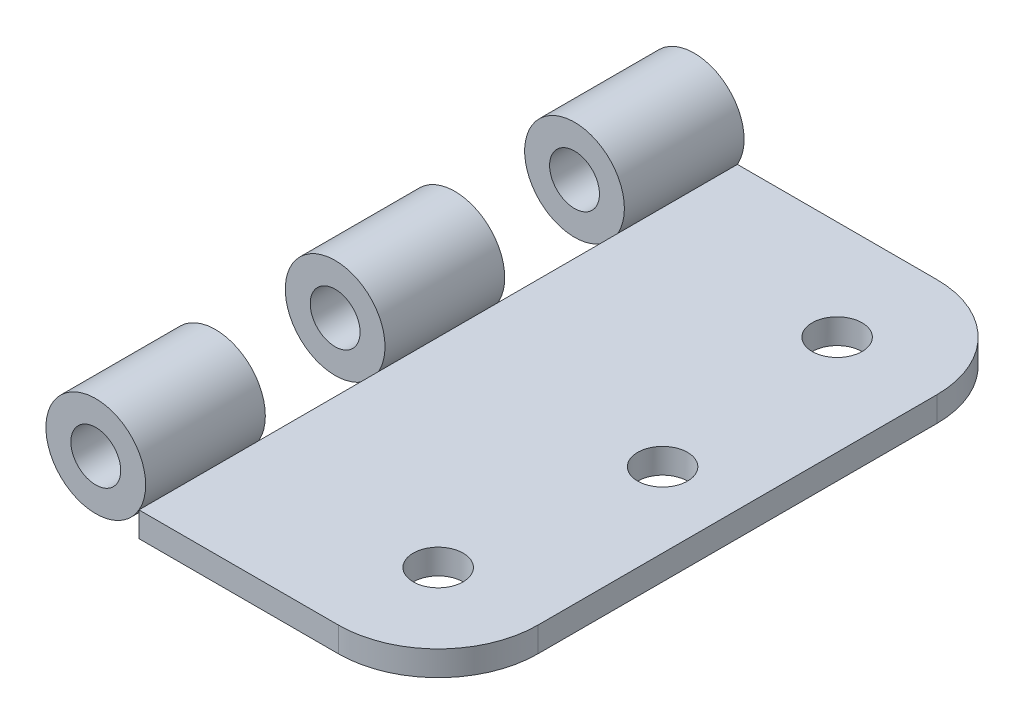
ISO-10303-21;
HEADER;
FILE_DESCRIPTION(('STEP AP214'),'2;1');
FILE_NAME('part.step','',(''),(''),'','','');
FILE_SCHEMA(('AUTOMOTIVE_DESIGN { 1 0 10303 214 1 1 1 1 }'));
ENDSEC;
DATA;
#1=APPLICATION_CONTEXT('core data for automotive mechanical design processes');
#2=APPLICATION_PROTOCOL_DEFINITION('international standard','automotive_design',2000,#1);
#3=PRODUCT_CONTEXT('',#1,'mechanical');
#4=PRODUCT('Part','Part','',(#3));
#5=PRODUCT_RELATED_PRODUCT_CATEGORY('part','',(#4));
#6=PRODUCT_DEFINITION_FORMATION('','',#4);
#7=PRODUCT_DEFINITION_CONTEXT('part definition',#1,'design');
#8=PRODUCT_DEFINITION('design','',#6,#7);
#9=PRODUCT_DEFINITION_SHAPE('','',#8);
#10=(LENGTH_UNIT() NAMED_UNIT(*) SI_UNIT(.MILLI.,.METRE.));
#11=(NAMED_UNIT(*) PLANE_ANGLE_UNIT() SI_UNIT($,.RADIAN.));
#12=(NAMED_UNIT(*) SI_UNIT($,.STERADIAN.) SOLID_ANGLE_UNIT());
#13=UNCERTAINTY_MEASURE_WITH_UNIT(LENGTH_MEASURE(1.E-05),#10,'distance_accuracy_value','');
#14=(GEOMETRIC_REPRESENTATION_CONTEXT(3) GLOBAL_UNCERTAINTY_ASSIGNED_CONTEXT((#13)) GLOBAL_UNIT_ASSIGNED_CONTEXT((#10,
#11,#12)) REPRESENTATION_CONTEXT('',''));
#15=CARTESIAN_POINT('',(0.,0.,0.));
#16=DIRECTION('',(0.,0.,1.));
#17=DIRECTION('',(1.,0.,0.));
#18=AXIS2_PLACEMENT_3D('',#15,#16,#17);
#19=CARTESIAN_POINT('',(0.,3.175,0.));
#20=DIRECTION('',(1.,0.,0.));
#21=DIRECTION('',(0.,0.,-1.));
#22=AXIS2_PLACEMENT_3D('',#19,#20,#21);
#23=PLANE('',#22);
#24=DIRECTION('',(0.,0.,1.));
#25=VECTOR('',#24,1.);
#26=CARTESIAN_POINT('',(0.,0.,0.));
#27=LINE('',#26,#25);
#28=CARTESIAN_POINT('',(0.,0.,-76.2));
#29=VERTEX_POINT('',#28);
#30=CARTESIAN_POINT('',(0.,0.,0.));
#31=VERTEX_POINT('',#30);
#32=EDGE_CURVE('P0_E89',#29,#31,#27,.T.);
#33=ORIENTED_EDGE('',*,*,#32,.T.);
#34=DIRECTION('',(0.,-1.,0.));
#35=VECTOR('',#34,1.);
#36=CARTESIAN_POINT('',(0.,3.175,0.));
#37=LINE('',#36,#35);
#38=CARTESIAN_POINT('',(0.,3.175,0.));
#39=VERTEX_POINT('',#38);
#40=EDGE_CURVE('P0_E84',#39,#31,#37,.T.);
#41=ORIENTED_EDGE('',*,*,#40,.F.);
#42=DIRECTION('',(0.,0.,1.));
#43=VECTOR('',#42,1.);
#44=CARTESIAN_POINT('',(0.,3.175,0.));
#45=LINE('',#44,#43);
#46=CARTESIAN_POINT('',(0.,3.175,-76.2));
#47=VERTEX_POINT('',#46);
#48=EDGE_CURVE('P0_E71',#47,#39,#45,.T.);
#49=ORIENTED_EDGE('',*,*,#48,.F.);
#50=DIRECTION('',(0.,-1.,0.));
#51=VECTOR('',#50,1.);
#52=CARTESIAN_POINT('',(0.,3.175,-76.2));
#53=LINE('',#52,#51);
#54=EDGE_CURVE('P0_E91',#47,#29,#53,.T.);
#55=ORIENTED_EDGE('',*,*,#54,.T.);
#56=EDGE_LOOP('',(#33,#41,#49,#55));
#57=FACE_BOUND('',#56,.T.);
#58=ADVANCED_FACE('P0_F17',(#57),#23,.F.);
#59=CARTESIAN_POINT('',(0.,3.175,0.));
#60=DIRECTION('',(0.,0.,-1.));
#61=DIRECTION('',(-1.,0.,0.));
#62=AXIS2_PLACEMENT_3D('',#59,#60,#61);
#63=PLANE('',#62);
#64=DIRECTION('',(1.,0.,0.));
#65=VECTOR('',#64,1.);
#66=CARTESIAN_POINT('',(0.,0.,0.));
#67=LINE('',#66,#65);
#68=CARTESIAN_POINT('',(25.4,0.,0.));
#69=VERTEX_POINT('',#68);
#70=EDGE_CURVE('P0_E117',#31,#69,#67,.T.);
#71=ORIENTED_EDGE('',*,*,#70,.T.);
#72=DIRECTION('',(0.,-1.,0.));
#73=VECTOR('',#72,1.);
#74=CARTESIAN_POINT('',(25.4,3.175,0.));
#75=LINE('',#74,#73);
#76=CARTESIAN_POINT('',(25.4,3.175,0.));
#77=VERTEX_POINT('',#76);
#78=EDGE_CURVE('P0_E40',#69,#77,#75,.F.);
#79=ORIENTED_EDGE('',*,*,#78,.T.);
#80=DIRECTION('',(1.,0.,0.));
#81=VECTOR('',#80,1.);
#82=CARTESIAN_POINT('',(0.,3.175,0.));
#83=LINE('',#82,#81);
#84=EDGE_CURVE('P0_E73',#39,#77,#83,.T.);
#85=ORIENTED_EDGE('',*,*,#84,.F.);
#86=ORIENTED_EDGE('',*,*,#40,.T.);
#87=EDGE_LOOP('',(#71,#79,#85,#86));
#88=FACE_BOUND('',#87,.T.);
#89=ADVANCED_FACE('P0_F83',(#88),#63,.F.);
#90=CARTESIAN_POINT('',(38.1,3.175,0.));
#91=DIRECTION('',(-1.,0.,0.));
#92=DIRECTION('',(0.,0.,1.));
#93=AXIS2_PLACEMENT_3D('',#90,#91,#92);
#94=PLANE('',#93);
#95=DIRECTION('',(0.,0.,-1.));
#96=VECTOR('',#95,1.);
#97=CARTESIAN_POINT('',(38.1,3.175,0.));
#98=LINE('',#97,#96);
#99=CARTESIAN_POINT('',(38.1,3.175,-12.7));
#100=VERTEX_POINT('',#99);
#101=CARTESIAN_POINT('',(38.1,3.175,-63.5));
#102=VERTEX_POINT('',#101);
#103=EDGE_CURVE('P0_E86',#100,#102,#98,.T.);
#104=ORIENTED_EDGE('',*,*,#103,.F.);
#105=DIRECTION('',(0.,-1.,0.));
#106=VECTOR('',#105,1.);
#107=CARTESIAN_POINT('',(38.1,3.175,-12.7));
#108=LINE('',#107,#106);
#109=CARTESIAN_POINT('',(38.1,0.,-12.7));
#110=VERTEX_POINT('',#109);
#111=EDGE_CURVE('P0_E93',#100,#110,#108,.T.);
#112=ORIENTED_EDGE('',*,*,#111,.T.);
#113=DIRECTION('',(0.,0.,-1.));
#114=VECTOR('',#113,1.);
#115=CARTESIAN_POINT('',(38.1,0.,0.));
#116=LINE('',#115,#114);
#117=CARTESIAN_POINT('',(38.1,0.,-63.5));
#118=VERTEX_POINT('',#117);
#119=EDGE_CURVE('P0_E118',#110,#118,#116,.T.);
#120=ORIENTED_EDGE('',*,*,#119,.T.);
#121=DIRECTION('',(0.,-1.,0.));
#122=VECTOR('',#121,1.);
#123=CARTESIAN_POINT('',(38.1,3.175,-63.5));
#124=LINE('',#123,#122);
#125=EDGE_CURVE('P0_E90',#118,#102,#124,.F.);
#126=ORIENTED_EDGE('',*,*,#125,.T.);
#127=EDGE_LOOP('',(#104,#112,#120,#126));
#128=FACE_BOUND('',#127,.T.);
#129=ADVANCED_FACE('P0_F109',(#128),#94,.F.);
#130=CARTESIAN_POINT('',(0.,3.175,-76.2));
#131=DIRECTION('',(0.,0.,1.));
#132=DIRECTION('',(1.,0.,0.));
#133=AXIS2_PLACEMENT_3D('',#130,#131,#132);
#134=PLANE('',#133);
#135=DIRECTION('',(-1.,0.,0.));
#136=VECTOR('',#135,1.);
#137=CARTESIAN_POINT('',(0.,3.175,-76.2));
#138=LINE('',#137,#136);
#139=CARTESIAN_POINT('',(25.4,3.175,-76.2));
#140=VERTEX_POINT('',#139);
#141=EDGE_CURVE('P0_E75',#140,#47,#138,.T.);
#142=ORIENTED_EDGE('',*,*,#141,.F.);
#143=DIRECTION('',(0.,-1.,0.));
#144=VECTOR('',#143,1.);
#145=CARTESIAN_POINT('',(25.4,3.175,-76.2));
#146=LINE('',#145,#144);
#147=CARTESIAN_POINT('',(25.4,0.,-76.2));
#148=VERTEX_POINT('',#147);
#149=EDGE_CURVE('P0_E11',#140,#148,#146,.T.);
#150=ORIENTED_EDGE('',*,*,#149,.T.);
#151=DIRECTION('',(-1.,0.,0.));
#152=VECTOR('',#151,1.);
#153=CARTESIAN_POINT('',(0.,0.,-76.2));
#154=LINE('',#153,#152);
#155=EDGE_CURVE('P0_E80',#148,#29,#154,.T.);
#156=ORIENTED_EDGE('',*,*,#155,.T.);
#157=ORIENTED_EDGE('',*,*,#54,.F.);
#158=EDGE_LOOP('',(#142,#150,#156,#157));
#159=FACE_BOUND('',#158,.T.);
#160=ADVANCED_FACE('P0_F126',(#159),#134,.F.);
#161=CARTESIAN_POINT('',(0.,3.175,-76.2));
#162=DIRECTION('',(0.,-1.,0.));
#163=DIRECTION('',(0.,0.,-1.));
#164=AXIS2_PLACEMENT_3D('',#161,#162,#163);
#165=PLANE('',#164);
#166=CARTESIAN_POINT('',(25.4,3.175,-12.7));
#167=DIRECTION('',(0.,1.,0.));
#168=DIRECTION('',(0.,0.,-1.));
#169=AXIS2_PLACEMENT_3D('',#166,#167,#168);
#170=CIRCLE('',#169,3.175);
#171=CARTESIAN_POINT('',(25.4,3.175,-15.875));
#172=VERTEX_POINT('',#171);
#173=EDGE_CURVE('P0_E173',#172,#172,#170,.T.);
#174=ORIENTED_EDGE('',*,*,#173,.F.);
#175=EDGE_LOOP('',(#174));
#176=FACE_BOUND('',#175,.T.);
#177=CARTESIAN_POINT('',(28.575,3.175,-38.1));
#178=DIRECTION('',(0.,1.,0.));
#179=DIRECTION('',(0.,0.,1.));
#180=AXIS2_PLACEMENT_3D('',#177,#178,#179);
#181=CIRCLE('',#180,3.175);
#182=CARTESIAN_POINT('',(28.575,3.175,-34.925));
#183=VERTEX_POINT('',#182);
#184=EDGE_CURVE('P0_E177',#183,#183,#181,.T.);
#185=ORIENTED_EDGE('',*,*,#184,.F.);
#186=EDGE_LOOP('',(#185));
#187=FACE_BOUND('',#186,.T.);
#188=CARTESIAN_POINT('',(25.4,3.175,-63.5));
#189=DIRECTION('',(0.,1.,0.));
#190=DIRECTION('',(0.,0.,1.));
#191=AXIS2_PLACEMENT_3D('',#188,#189,#190);
#192=CIRCLE('',#191,3.175);
#193=CARTESIAN_POINT('',(25.4,3.175,-60.325));
#194=VERTEX_POINT('',#193);
#195=EDGE_CURVE('P0_E121',#194,#194,#192,.T.);
#196=ORIENTED_EDGE('',*,*,#195,.F.);
#197=EDGE_LOOP('',(#196));
#198=FACE_BOUND('',#197,.T.);
#199=ORIENTED_EDGE('',*,*,#84,.T.);
#200=CARTESIAN_POINT('',(25.4,3.175,-12.7));
#201=DIRECTION('',(0.,-1.,0.));
#202=DIRECTION('',(0.,0.,-1.));
#203=AXIS2_PLACEMENT_3D('',#200,#201,#202);
#204=CIRCLE('',#203,12.7);
#205=EDGE_CURVE('P0_E25',#77,#100,#204,.F.);
#206=ORIENTED_EDGE('',*,*,#205,.T.);
#207=ORIENTED_EDGE('',*,*,#103,.T.);
#208=CARTESIAN_POINT('',(25.4,3.175,-63.5));
#209=DIRECTION('',(0.,-1.,0.));
#210=DIRECTION('',(0.,0.,-1.));
#211=AXIS2_PLACEMENT_3D('',#208,#209,#210);
#212=CIRCLE('',#211,12.7);
#213=EDGE_CURVE('P0_E32',#102,#140,#212,.F.);
#214=ORIENTED_EDGE('',*,*,#213,.T.);
#215=ORIENTED_EDGE('',*,*,#141,.T.);
#216=ORIENTED_EDGE('',*,*,#48,.T.);
#217=EDGE_LOOP('',(#199,#206,#207,#214,#215,#216));
#218=FACE_BOUND('',#217,.T.);
#219=ADVANCED_FACE('P0_F72',(#176,#187,#198,#218),#165,.F.);
#220=CARTESIAN_POINT('',(0.,0.,-76.2));
#221=DIRECTION('',(0.,-1.,0.));
#222=DIRECTION('',(0.,0.,-1.));
#223=AXIS2_PLACEMENT_3D('',#220,#221,#222);
#224=PLANE('',#223);
#225=CARTESIAN_POINT('',(25.4,0.,-12.7));
#226=DIRECTION('',(0.,-1.,0.));
#227=DIRECTION('',(0.,0.,-1.));
#228=AXIS2_PLACEMENT_3D('',#225,#226,#227);
#229=CIRCLE('',#228,3.175);
#230=CARTESIAN_POINT('',(25.4,0.,-15.875));
#231=VERTEX_POINT('',#230);
#232=EDGE_CURVE('P0_E170',#231,#231,#229,.F.);
#233=ORIENTED_EDGE('',*,*,#232,.T.);
#234=EDGE_LOOP('',(#233));
#235=FACE_BOUND('',#234,.T.);
#236=CARTESIAN_POINT('',(28.575,0.,-38.1));
#237=DIRECTION('',(0.,-1.,0.));
#238=DIRECTION('',(0.,0.,-1.));
#239=AXIS2_PLACEMENT_3D('',#236,#237,#238);
#240=CIRCLE('',#239,3.175);
#241=CARTESIAN_POINT('',(28.575,0.,-41.275));
#242=VERTEX_POINT('',#241);
#243=EDGE_CURVE('P0_E174',#242,#242,#240,.F.);
#244=ORIENTED_EDGE('',*,*,#243,.T.);
#245=EDGE_LOOP('',(#244));
#246=FACE_BOUND('',#245,.T.);
#247=CARTESIAN_POINT('',(25.4,0.,-63.5));
#248=DIRECTION('',(0.,-1.,0.));
#249=DIRECTION('',(0.,0.,-1.));
#250=AXIS2_PLACEMENT_3D('',#247,#248,#249);
#251=CIRCLE('',#250,3.175);
#252=CARTESIAN_POINT('',(25.4,0.,-66.675));
#253=VERTEX_POINT('',#252);
#254=EDGE_CURVE('P0_E182',#253,#253,#251,.F.);
#255=ORIENTED_EDGE('',*,*,#254,.T.);
#256=EDGE_LOOP('',(#255));
#257=FACE_BOUND('',#256,.T.);
#258=ORIENTED_EDGE('',*,*,#119,.F.);
#259=CARTESIAN_POINT('',(25.4,0.,-12.7));
#260=DIRECTION('',(0.,-1.,0.));
#261=DIRECTION('',(0.,0.,-1.));
#262=AXIS2_PLACEMENT_3D('',#259,#260,#261);
#263=CIRCLE('',#262,12.7);
#264=EDGE_CURVE('P0_E102',#110,#69,#263,.T.);
#265=ORIENTED_EDGE('',*,*,#264,.T.);
#266=ORIENTED_EDGE('',*,*,#70,.F.);
#267=ORIENTED_EDGE('',*,*,#32,.F.);
#268=ORIENTED_EDGE('',*,*,#155,.F.);
#269=CARTESIAN_POINT('',(25.4,0.,-63.5));
#270=DIRECTION('',(0.,-1.,0.));
#271=DIRECTION('',(0.,0.,-1.));
#272=AXIS2_PLACEMENT_3D('',#269,#270,#271);
#273=CIRCLE('',#272,12.7);
#274=EDGE_CURVE('P0_E100',#148,#118,#273,.T.);
#275=ORIENTED_EDGE('',*,*,#274,.T.);
#276=EDGE_LOOP('',(#258,#265,#266,#267,#268,#275));
#277=FACE_BOUND('',#276,.T.);
#278=ADVANCED_FACE('P0_F116',(#235,#246,#257,#277),#224,.T.);
#279=CARTESIAN_POINT('',(25.4,-0.00100000000000013,-63.5));
#280=DIRECTION('',(0.,1.,0.));
#281=DIRECTION('',(0.,0.,1.));
#282=AXIS2_PLACEMENT_3D('',#279,#280,#281);
#283=CYLINDRICAL_SURFACE('',#282,3.175);
#284=ORIENTED_EDGE('',*,*,#254,.F.);
#285=EDGE_LOOP('',(#284));
#286=FACE_BOUND('',#285,.T.);
#287=ORIENTED_EDGE('',*,*,#195,.T.);
#288=EDGE_LOOP('',(#287));
#289=FACE_BOUND('',#288,.T.);
#290=ADVANCED_FACE('P0_F150',(#286,#289),#283,.F.);
#291=CARTESIAN_POINT('',(28.575,-0.00100000000000013,-38.1));
#292=DIRECTION('',(0.,1.,0.));
#293=DIRECTION('',(0.,0.,1.));
#294=AXIS2_PLACEMENT_3D('',#291,#292,#293);
#295=CYLINDRICAL_SURFACE('',#294,3.175);
#296=ORIENTED_EDGE('',*,*,#243,.F.);
#297=EDGE_LOOP('',(#296));
#298=FACE_BOUND('',#297,.T.);
#299=ORIENTED_EDGE('',*,*,#184,.T.);
#300=EDGE_LOOP('',(#299));
#301=FACE_BOUND('',#300,.T.);
#302=ADVANCED_FACE('P0_F157',(#298,#301),#295,.F.);
#303=CARTESIAN_POINT('',(25.4,-0.00100000000000013,-12.7));
#304=DIRECTION('',(0.,1.,0.));
#305=DIRECTION('',(0.,0.,1.));
#306=AXIS2_PLACEMENT_3D('',#303,#304,#305);
#307=CYLINDRICAL_SURFACE('',#306,3.175);
#308=ORIENTED_EDGE('',*,*,#232,.F.);
#309=EDGE_LOOP('',(#308));
#310=FACE_BOUND('',#309,.T.);
#311=ORIENTED_EDGE('',*,*,#173,.T.);
#312=EDGE_LOOP('',(#311));
#313=FACE_BOUND('',#312,.T.);
#314=ADVANCED_FACE('P0_F135',(#310,#313),#307,.F.);
#315=CARTESIAN_POINT('',(25.4,3.175,-12.7));
#316=DIRECTION('',(0.,-1.,0.));
#317=DIRECTION('',(0.,0.,-1.));
#318=AXIS2_PLACEMENT_3D('',#315,#316,#317);
#319=CYLINDRICAL_SURFACE('',#318,12.7);
#320=ORIENTED_EDGE('',*,*,#205,.F.);
#321=ORIENTED_EDGE('',*,*,#78,.F.);
#322=ORIENTED_EDGE('',*,*,#264,.F.);
#323=ORIENTED_EDGE('',*,*,#111,.F.);
#324=EDGE_LOOP('',(#320,#321,#322,#323));
#325=FACE_BOUND('',#324,.T.);
#326=ADVANCED_FACE('P0_F114',(#325),#319,.T.);
#327=CARTESIAN_POINT('',(25.4,3.175,-63.5));
#328=DIRECTION('',(0.,-1.,0.));
#329=DIRECTION('',(0.,0.,-1.));
#330=AXIS2_PLACEMENT_3D('',#327,#328,#329);
#331=CYLINDRICAL_SURFACE('',#330,12.7);
#332=ORIENTED_EDGE('',*,*,#213,.F.);
#333=ORIENTED_EDGE('',*,*,#125,.F.);
#334=ORIENTED_EDGE('',*,*,#274,.F.);
#335=ORIENTED_EDGE('',*,*,#149,.F.);
#336=EDGE_LOOP('',(#332,#333,#334,#335));
#337=FACE_BOUND('',#336,.T.);
#338=ADVANCED_FACE('P0_F19',(#337),#331,.T.);
#339=CLOSED_SHELL('',(#58,#89,#129,#160,#219,#278,#290,#302,#314,#326,#338));
#340=MANIFOLD_SOLID_BREP('P0_B1',#339);
#341=CARTESIAN_POINT('',(-5.49926131403119,6.35,-15.24));
#342=DIRECTION('',(0.,0.,1.));
#343=DIRECTION('',(1.,0.,0.));
#344=AXIS2_PLACEMENT_3D('',#341,#342,#343);
#345=CYLINDRICAL_SURFACE('',#344,6.35);
#346=CARTESIAN_POINT('',(-5.49926131403119,6.35,-15.24));
#347=DIRECTION('',(0.,0.,1.));
#348=DIRECTION('',(1.,0.,0.));
#349=AXIS2_PLACEMENT_3D('',#346,#347,#348);
#350=CIRCLE('',#349,6.35);
#351=CARTESIAN_POINT('',(0.85073868596881,6.35,-15.24));
#352=VERTEX_POINT('',#351);
#353=EDGE_CURVE('P1_E10',#352,#352,#350,.T.);
#354=ORIENTED_EDGE('',*,*,#353,.T.);
#355=EDGE_LOOP('',(#354));
#356=FACE_BOUND('',#355,.T.);
#357=CARTESIAN_POINT('',(-5.49926131403119,6.35,0.));
#358=DIRECTION('',(0.,0.,1.));
#359=DIRECTION('',(1.,0.,0.));
#360=AXIS2_PLACEMENT_3D('',#357,#358,#359);
#361=CIRCLE('',#360,6.35);
#362=CARTESIAN_POINT('',(0.85073868596881,6.35,0.));
#363=VERTEX_POINT('',#362);
#364=EDGE_CURVE('P1_E18',#363,#363,#361,.T.);
#365=ORIENTED_EDGE('',*,*,#364,.F.);
#366=EDGE_LOOP('',(#365));
#367=FACE_BOUND('',#366,.T.);
#368=ADVANCED_FACE('P1_F15',(#356,#367),#345,.T.);
#369=CARTESIAN_POINT('',(-5.49926131403119,6.35,-15.24));
#370=DIRECTION('',(0.,0.,1.));
#371=DIRECTION('',(1.,0.,0.));
#372=AXIS2_PLACEMENT_3D('',#369,#370,#371);
#373=PLANE('',#372);
#374=CARTESIAN_POINT('',(-5.49926131403119,6.35,-15.24));
#375=DIRECTION('',(0.,0.,1.));
#376=DIRECTION('',(1.,0.,0.));
#377=AXIS2_PLACEMENT_3D('',#374,#375,#376);
#378=CIRCLE('',#377,3.175);
#379=CARTESIAN_POINT('',(-2.32426131403119,6.35,-15.24));
#380=VERTEX_POINT('',#379);
#381=EDGE_CURVE('P1_E25',#380,#380,#378,.T.);
#382=ORIENTED_EDGE('',*,*,#381,.T.);
#383=EDGE_LOOP('',(#382));
#384=FACE_BOUND('',#383,.T.);
#385=ORIENTED_EDGE('',*,*,#353,.F.);
#386=EDGE_LOOP('',(#385));
#387=FACE_BOUND('',#386,.T.);
#388=ADVANCED_FACE('P1_F33',(#384,#387),#373,.F.);
#389=CARTESIAN_POINT('',(-5.49926131403119,6.35,0.));
#390=DIRECTION('',(0.,0.,1.));
#391=DIRECTION('',(1.,0.,0.));
#392=AXIS2_PLACEMENT_3D('',#389,#390,#391);
#393=PLANE('',#392);
#394=CARTESIAN_POINT('',(-5.49926131403119,6.35,0.));
#395=DIRECTION('',(0.,0.,1.));
#396=DIRECTION('',(1.,0.,0.));
#397=AXIS2_PLACEMENT_3D('',#394,#395,#396);
#398=CIRCLE('',#397,3.175);
#399=CARTESIAN_POINT('',(-2.32426131403119,6.35,0.));
#400=VERTEX_POINT('',#399);
#401=EDGE_CURVE('P1_E27',#400,#400,#398,.T.);
#402=ORIENTED_EDGE('',*,*,#401,.F.);
#403=EDGE_LOOP('',(#402));
#404=FACE_BOUND('',#403,.T.);
#405=ORIENTED_EDGE('',*,*,#364,.T.);
#406=EDGE_LOOP('',(#405));
#407=FACE_BOUND('',#406,.T.);
#408=ADVANCED_FACE('P1_F39',(#404,#407),#393,.T.);
#409=CARTESIAN_POINT('',(-5.49926131403119,6.35,-15.24));
#410=DIRECTION('',(0.,0.,1.));
#411=DIRECTION('',(1.,0.,0.));
#412=AXIS2_PLACEMENT_3D('',#409,#410,#411);
#413=CYLINDRICAL_SURFACE('',#412,3.175);
#414=ORIENTED_EDGE('',*,*,#381,.F.);
#415=EDGE_LOOP('',(#414));
#416=FACE_BOUND('',#415,.T.);
#417=ORIENTED_EDGE('',*,*,#401,.T.);
#418=EDGE_LOOP('',(#417));
#419=FACE_BOUND('',#418,.T.);
#420=ADVANCED_FACE('P1_F36',(#416,#419),#413,.F.);
#421=CLOSED_SHELL('',(#368,#388,#408,#420));
#422=MANIFOLD_SOLID_BREP('P1_B1',#421);
#423=CARTESIAN_POINT('',(-5.49926131403119,6.35,-45.72));
#424=DIRECTION('',(0.,0.,1.));
#425=DIRECTION('',(1.,0.,0.));
#426=AXIS2_PLACEMENT_3D('',#423,#424,#425);
#427=CYLINDRICAL_SURFACE('',#426,6.35);
#428=CARTESIAN_POINT('',(-5.49926131403119,6.35,-45.72));
#429=DIRECTION('',(0.,0.,1.));
#430=DIRECTION('',(1.,0.,0.));
#431=AXIS2_PLACEMENT_3D('',#428,#429,#430);
#432=CIRCLE('',#431,6.35);
#433=CARTESIAN_POINT('',(0.85073868596881,6.35,-45.72));
#434=VERTEX_POINT('',#433);
#435=EDGE_CURVE('P2_E10',#434,#434,#432,.T.);
#436=ORIENTED_EDGE('',*,*,#435,.T.);
#437=EDGE_LOOP('',(#436));
#438=FACE_BOUND('',#437,.T.);
#439=CARTESIAN_POINT('',(-5.49926131403119,6.35,-30.48));
#440=DIRECTION('',(0.,0.,1.));
#441=DIRECTION('',(1.,0.,0.));
#442=AXIS2_PLACEMENT_3D('',#439,#440,#441);
#443=CIRCLE('',#442,6.35);
#444=CARTESIAN_POINT('',(0.85073868596881,6.35,-30.48));
#445=VERTEX_POINT('',#444);
#446=EDGE_CURVE('P2_E18',#445,#445,#443,.T.);
#447=ORIENTED_EDGE('',*,*,#446,.F.);
#448=EDGE_LOOP('',(#447));
#449=FACE_BOUND('',#448,.T.);
#450=ADVANCED_FACE('P2_F15',(#438,#449),#427,.T.);
#451=CARTESIAN_POINT('',(-5.49926131403119,6.35,-45.72));
#452=DIRECTION('',(0.,0.,1.));
#453=DIRECTION('',(1.,0.,0.));
#454=AXIS2_PLACEMENT_3D('',#451,#452,#453);
#455=PLANE('',#454);
#456=CARTESIAN_POINT('',(-5.49926131403119,6.35,-45.72));
#457=DIRECTION('',(0.,0.,1.));
#458=DIRECTION('',(1.,0.,0.));
#459=AXIS2_PLACEMENT_3D('',#456,#457,#458);
#460=CIRCLE('',#459,3.175);
#461=CARTESIAN_POINT('',(-2.32426131403119,6.35,-45.72));
#462=VERTEX_POINT('',#461);
#463=EDGE_CURVE('P2_E25',#462,#462,#460,.T.);
#464=ORIENTED_EDGE('',*,*,#463,.T.);
#465=EDGE_LOOP('',(#464));
#466=FACE_BOUND('',#465,.T.);
#467=ORIENTED_EDGE('',*,*,#435,.F.);
#468=EDGE_LOOP('',(#467));
#469=FACE_BOUND('',#468,.T.);
#470=ADVANCED_FACE('P2_F33',(#466,#469),#455,.F.);
#471=CARTESIAN_POINT('',(-5.49926131403119,6.35,-30.48));
#472=DIRECTION('',(0.,0.,1.));
#473=DIRECTION('',(1.,0.,0.));
#474=AXIS2_PLACEMENT_3D('',#471,#472,#473);
#475=PLANE('',#474);
#476=CARTESIAN_POINT('',(-5.49926131403119,6.35,-30.48));
#477=DIRECTION('',(0.,0.,1.));
#478=DIRECTION('',(1.,0.,0.));
#479=AXIS2_PLACEMENT_3D('',#476,#477,#478);
#480=CIRCLE('',#479,3.175);
#481=CARTESIAN_POINT('',(-2.32426131403119,6.35,-30.48));
#482=VERTEX_POINT('',#481);
#483=EDGE_CURVE('P2_E27',#482,#482,#480,.T.);
#484=ORIENTED_EDGE('',*,*,#483,.F.);
#485=EDGE_LOOP('',(#484));
#486=FACE_BOUND('',#485,.T.);
#487=ORIENTED_EDGE('',*,*,#446,.T.);
#488=EDGE_LOOP('',(#487));
#489=FACE_BOUND('',#488,.T.);
#490=ADVANCED_FACE('P2_F39',(#486,#489),#475,.T.);
#491=CARTESIAN_POINT('',(-5.49926131403119,6.35,-45.72));
#492=DIRECTION('',(0.,0.,1.));
#493=DIRECTION('',(1.,0.,0.));
#494=AXIS2_PLACEMENT_3D('',#491,#492,#493);
#495=CYLINDRICAL_SURFACE('',#494,3.175);
#496=ORIENTED_EDGE('',*,*,#463,.F.);
#497=EDGE_LOOP('',(#496));
#498=FACE_BOUND('',#497,.T.);
#499=ORIENTED_EDGE('',*,*,#483,.T.);
#500=EDGE_LOOP('',(#499));
#501=FACE_BOUND('',#500,.T.);
#502=ADVANCED_FACE('P2_F36',(#498,#501),#495,.F.);
#503=CLOSED_SHELL('',(#450,#470,#490,#502));
#504=MANIFOLD_SOLID_BREP('P2_B1',#503);
#505=CARTESIAN_POINT('',(-5.49926131403119,6.35,-76.2));
#506=DIRECTION('',(0.,0.,1.));
#507=DIRECTION('',(1.,0.,0.));
#508=AXIS2_PLACEMENT_3D('',#505,#506,#507);
#509=CYLINDRICAL_SURFACE('',#508,6.35);
#510=CARTESIAN_POINT('',(-5.49926131403119,6.35,-76.2));
#511=DIRECTION('',(0.,0.,1.));
#512=DIRECTION('',(1.,0.,0.));
#513=AXIS2_PLACEMENT_3D('',#510,#511,#512);
#514=CIRCLE('',#513,6.35);
#515=CARTESIAN_POINT('',(0.85073868596881,6.35,-76.2));
#516=VERTEX_POINT('',#515);
#517=EDGE_CURVE('P3_E10',#516,#516,#514,.T.);
#518=ORIENTED_EDGE('',*,*,#517,.T.);
#519=EDGE_LOOP('',(#518));
#520=FACE_BOUND('',#519,.T.);
#521=CARTESIAN_POINT('',(-5.49926131403119,6.35,-60.96));
#522=DIRECTION('',(0.,0.,1.));
#523=DIRECTION('',(1.,0.,0.));
#524=AXIS2_PLACEMENT_3D('',#521,#522,#523);
#525=CIRCLE('',#524,6.35);
#526=CARTESIAN_POINT('',(0.85073868596881,6.35,-60.96));
#527=VERTEX_POINT('',#526);
#528=EDGE_CURVE('P3_E18',#527,#527,#525,.T.);
#529=ORIENTED_EDGE('',*,*,#528,.F.);
#530=EDGE_LOOP('',(#529));
#531=FACE_BOUND('',#530,.T.);
#532=ADVANCED_FACE('P3_F15',(#520,#531),#509,.T.);
#533=CARTESIAN_POINT('',(-5.49926131403119,6.35,-76.2));
#534=DIRECTION('',(0.,0.,1.));
#535=DIRECTION('',(1.,0.,0.));
#536=AXIS2_PLACEMENT_3D('',#533,#534,#535);
#537=PLANE('',#536);
#538=CARTESIAN_POINT('',(-5.49926131403119,6.35,-76.2));
#539=DIRECTION('',(0.,0.,1.));
#540=DIRECTION('',(1.,0.,0.));
#541=AXIS2_PLACEMENT_3D('',#538,#539,#540);
#542=CIRCLE('',#541,3.175);
#543=CARTESIAN_POINT('',(-2.32426131403119,6.35,-76.2));
#544=VERTEX_POINT('',#543);
#545=EDGE_CURVE('P3_E25',#544,#544,#542,.T.);
#546=ORIENTED_EDGE('',*,*,#545,.T.);
#547=EDGE_LOOP('',(#546));
#548=FACE_BOUND('',#547,.T.);
#549=ORIENTED_EDGE('',*,*,#517,.F.);
#550=EDGE_LOOP('',(#549));
#551=FACE_BOUND('',#550,.T.);
#552=ADVANCED_FACE('P3_F33',(#548,#551),#537,.F.);
#553=CARTESIAN_POINT('',(-5.49926131403119,6.35,-60.96));
#554=DIRECTION('',(0.,0.,1.));
#555=DIRECTION('',(1.,0.,0.));
#556=AXIS2_PLACEMENT_3D('',#553,#554,#555);
#557=PLANE('',#556);
#558=CARTESIAN_POINT('',(-5.49926131403119,6.35,-60.96));
#559=DIRECTION('',(0.,0.,1.));
#560=DIRECTION('',(1.,0.,0.));
#561=AXIS2_PLACEMENT_3D('',#558,#559,#560);
#562=CIRCLE('',#561,3.175);
#563=CARTESIAN_POINT('',(-2.32426131403119,6.35,-60.96));
#564=VERTEX_POINT('',#563);
#565=EDGE_CURVE('P3_E27',#564,#564,#562,.T.);
#566=ORIENTED_EDGE('',*,*,#565,.F.);
#567=EDGE_LOOP('',(#566));
#568=FACE_BOUND('',#567,.T.);
#569=ORIENTED_EDGE('',*,*,#528,.T.);
#570=EDGE_LOOP('',(#569));
#571=FACE_BOUND('',#570,.T.);
#572=ADVANCED_FACE('P3_F39',(#568,#571),#557,.T.);
#573=CARTESIAN_POINT('',(-5.49926131403119,6.35,-76.2));
#574=DIRECTION('',(0.,0.,1.));
#575=DIRECTION('',(1.,0.,0.));
#576=AXIS2_PLACEMENT_3D('',#573,#574,#575);
#577=CYLINDRICAL_SURFACE('',#576,3.175);
#578=ORIENTED_EDGE('',*,*,#545,.F.);
#579=EDGE_LOOP('',(#578));
#580=FACE_BOUND('',#579,.T.);
#581=ORIENTED_EDGE('',*,*,#565,.T.);
#582=EDGE_LOOP('',(#581));
#583=FACE_BOUND('',#582,.T.);
#584=ADVANCED_FACE('P3_F36',(#580,#583),#577,.F.);
#585=CLOSED_SHELL('',(#532,#552,#572,#584));
#586=MANIFOLD_SOLID_BREP('P3_B1',#585);
#587=ADVANCED_BREP_SHAPE_REPRESENTATION('',(#18,#340,#422,#504,#586),#14);
#588=SHAPE_DEFINITION_REPRESENTATION(#9,#587);
ENDSEC;
END-ISO-10303-21;
